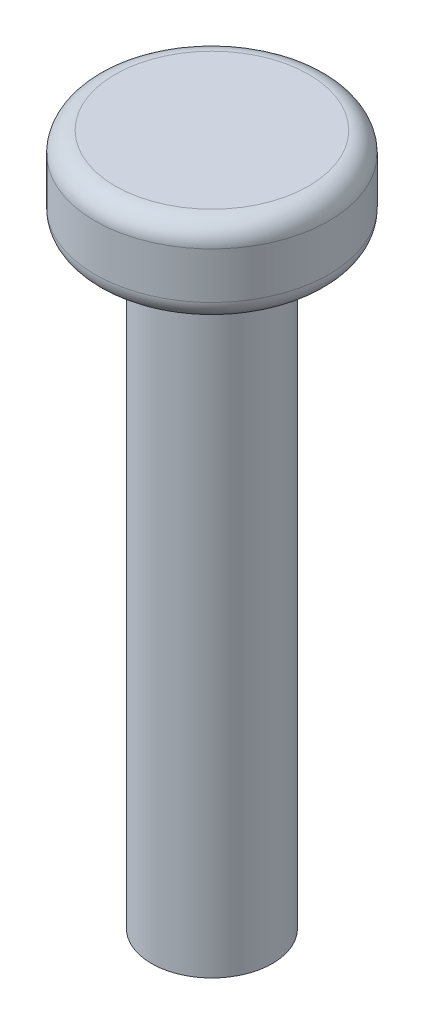
ISO-10303-21;
HEADER;
FILE_DESCRIPTION(('STEP AP214'),'2;1');
FILE_NAME('part.step','',(''),(''),'','','');
FILE_SCHEMA(('AUTOMOTIVE_DESIGN { 1 0 10303 214 1 1 1 1 }'));
ENDSEC;
DATA;
#1=APPLICATION_CONTEXT('core data for automotive mechanical design processes');
#2=APPLICATION_PROTOCOL_DEFINITION('international standard','automotive_design',2000,#1);
#3=PRODUCT_CONTEXT('',#1,'mechanical');
#4=PRODUCT('Part','Part','',(#3));
#5=PRODUCT_RELATED_PRODUCT_CATEGORY('part','',(#4));
#6=PRODUCT_DEFINITION_FORMATION('','',#4);
#7=PRODUCT_DEFINITION_CONTEXT('part definition',#1,'design');
#8=PRODUCT_DEFINITION('design','',#6,#7);
#9=PRODUCT_DEFINITION_SHAPE('','',#8);
#10=(LENGTH_UNIT() NAMED_UNIT(*) SI_UNIT(.MILLI.,.METRE.));
#11=(NAMED_UNIT(*) PLANE_ANGLE_UNIT() SI_UNIT($,.RADIAN.));
#12=(NAMED_UNIT(*) SI_UNIT($,.STERADIAN.) SOLID_ANGLE_UNIT());
#13=UNCERTAINTY_MEASURE_WITH_UNIT(LENGTH_MEASURE(1.E-05),#10,'distance_accuracy_value','');
#14=(GEOMETRIC_REPRESENTATION_CONTEXT(3) GLOBAL_UNCERTAINTY_ASSIGNED_CONTEXT((#13)) GLOBAL_UNIT_ASSIGNED_CONTEXT((#10,
#11,#12)) REPRESENTATION_CONTEXT('',''));
#15=CARTESIAN_POINT('',(0.,0.,0.));
#16=DIRECTION('',(0.,0.,1.));
#17=DIRECTION('',(1.,0.,0.));
#18=AXIS2_PLACEMENT_3D('',#15,#16,#17);
#19=CARTESIAN_POINT('',(0.,30.,0.));
#20=DIRECTION('',(0.,-1.,0.));
#21=DIRECTION('',(0.,0.,-1.));
#22=AXIS2_PLACEMENT_3D('',#19,#20,#21);
#23=CYLINDRICAL_SURFACE('',#22,3.);
#24=CARTESIAN_POINT('',(0.,30.,0.));
#25=DIRECTION('',(0.,1.,0.));
#26=DIRECTION('',(0.,0.,1.));
#27=AXIS2_PLACEMENT_3D('',#24,#25,#26);
#28=CIRCLE('',#27,3.);
#29=CARTESIAN_POINT('',(0.,30.,3.));
#30=VERTEX_POINT('',#29);
#31=EDGE_CURVE('E53',#30,#30,#28,.T.);
#32=ORIENTED_EDGE('',*,*,#31,.F.);
#33=EDGE_LOOP('',(#32));
#34=FACE_BOUND('',#33,.T.);
#35=CARTESIAN_POINT('',(0.,0.,0.));
#36=DIRECTION('',(0.,1.,0.));
#37=DIRECTION('',(0.,0.,1.));
#38=AXIS2_PLACEMENT_3D('',#35,#36,#37);
#39=CIRCLE('',#38,3.);
#40=CARTESIAN_POINT('',(0.,0.,3.));
#41=VERTEX_POINT('',#40);
#42=EDGE_CURVE('E54',#41,#41,#39,.T.);
#43=ORIENTED_EDGE('',*,*,#42,.T.);
#44=EDGE_LOOP('',(#43));
#45=FACE_BOUND('',#44,.T.);
#46=ADVANCED_FACE('F33',(#34,#45),#23,.T.);
#47=CARTESIAN_POINT('',(0.,0.,0.));
#48=DIRECTION('',(0.,1.,0.));
#49=DIRECTION('',(0.,0.,1.));
#50=AXIS2_PLACEMENT_3D('',#47,#48,#49);
#51=PLANE('',#50);
#52=ORIENTED_EDGE('',*,*,#42,.F.);
#53=EDGE_LOOP('',(#52));
#54=FACE_BOUND('',#53,.T.);
#55=ADVANCED_FACE('F64',(#54),#51,.F.);
#56=CARTESIAN_POINT('',(0.,34.3,0.));
#57=DIRECTION('',(0.,-1.,0.));
#58=DIRECTION('',(0.,0.,-1.));
#59=AXIS2_PLACEMENT_3D('',#56,#57,#58);
#60=CYLINDRICAL_SURFACE('',#59,5.8);
#61=CARTESIAN_POINT('',(0.,31.,0.));
#62=DIRECTION('',(0.,1.,0.));
#63=DIRECTION('',(0.,0.,1.));
#64=AXIS2_PLACEMENT_3D('',#61,#62,#63);
#65=CIRCLE('',#64,5.8);
#66=CARTESIAN_POINT('',(0.,31.,5.8));
#67=VERTEX_POINT('',#66);
#68=EDGE_CURVE('E44',#67,#67,#65,.T.);
#69=ORIENTED_EDGE('',*,*,#68,.T.);
#70=EDGE_LOOP('',(#69));
#71=FACE_BOUND('',#70,.T.);
#72=CARTESIAN_POINT('',(0.,33.3,0.));
#73=DIRECTION('',(0.,1.,0.));
#74=DIRECTION('',(0.,0.,1.));
#75=AXIS2_PLACEMENT_3D('',#72,#73,#74);
#76=CIRCLE('',#75,5.8);
#77=CARTESIAN_POINT('',(0.,33.3,5.8));
#78=VERTEX_POINT('',#77);
#79=EDGE_CURVE('E48',#78,#78,#76,.F.);
#80=ORIENTED_EDGE('',*,*,#79,.T.);
#81=EDGE_LOOP('',(#80));
#82=FACE_BOUND('',#81,.T.);
#83=ADVANCED_FACE('F69',(#71,#82),#60,.T.);
#84=CARTESIAN_POINT('',(0.,34.3,0.));
#85=DIRECTION('',(0.,1.,0.));
#86=DIRECTION('',(0.,0.,1.));
#87=AXIS2_PLACEMENT_3D('',#84,#85,#86);
#88=PLANE('',#87);
#89=CARTESIAN_POINT('',(0.,34.3,0.));
#90=DIRECTION('',(0.,1.,0.));
#91=DIRECTION('',(0.,0.,1.));
#92=AXIS2_PLACEMENT_3D('',#89,#90,#91);
#93=CIRCLE('',#92,4.8);
#94=CARTESIAN_POINT('',(0.,34.3,4.8));
#95=VERTEX_POINT('',#94);
#96=EDGE_CURVE('E10',#95,#95,#93,.T.);
#97=ORIENTED_EDGE('',*,*,#96,.T.);
#98=EDGE_LOOP('',(#97));
#99=FACE_BOUND('',#98,.T.);
#100=ADVANCED_FACE('F74',(#99),#88,.T.);
#101=CARTESIAN_POINT('',(0.,30.,0.));
#102=DIRECTION('',(0.,1.,0.));
#103=DIRECTION('',(0.,0.,1.));
#104=AXIS2_PLACEMENT_3D('',#101,#102,#103);
#105=PLANE('',#104);
#106=CARTESIAN_POINT('',(0.,30.,0.));
#107=DIRECTION('',(0.,1.,0.));
#108=DIRECTION('',(0.,0.,1.));
#109=AXIS2_PLACEMENT_3D('',#106,#107,#108);
#110=CIRCLE('',#109,4.8);
#111=CARTESIAN_POINT('',(0.,30.,4.8));
#112=VERTEX_POINT('',#111);
#113=EDGE_CURVE('E40',#112,#112,#110,.F.);
#114=ORIENTED_EDGE('',*,*,#113,.T.);
#115=EDGE_LOOP('',(#114));
#116=FACE_BOUND('',#115,.T.);
#117=ORIENTED_EDGE('',*,*,#31,.T.);
#118=EDGE_LOOP('',(#117));
#119=FACE_BOUND('',#118,.T.);
#120=ADVANCED_FACE('F60',(#116,#119),#105,.F.);
#121=CARTESIAN_POINT('',(0.,31.,0.));
#122=DIRECTION('',(0.,1.,0.));
#123=DIRECTION('',(0.,0.,1.));
#124=AXIS2_PLACEMENT_3D('',#121,#122,#123);
#125=TOROIDAL_SURFACE('',#124,4.8,1.);
#126=ORIENTED_EDGE('',*,*,#113,.F.);
#127=EDGE_LOOP('',(#126));
#128=FACE_BOUND('',#127,.T.);
#129=ORIENTED_EDGE('',*,*,#68,.F.);
#130=EDGE_LOOP('',(#129));
#131=FACE_BOUND('',#130,.T.);
#132=ADVANCED_FACE('F78',(#128,#131),#125,.T.);
#133=CARTESIAN_POINT('',(0.,33.3,0.));
#134=DIRECTION('',(0.,1.,0.));
#135=DIRECTION('',(0.,0.,1.));
#136=AXIS2_PLACEMENT_3D('',#133,#134,#135);
#137=TOROIDAL_SURFACE('',#136,4.8,1.);
#138=ORIENTED_EDGE('',*,*,#79,.F.);
#139=EDGE_LOOP('',(#138));
#140=FACE_BOUND('',#139,.T.);
#141=ORIENTED_EDGE('',*,*,#96,.F.);
#142=EDGE_LOOP('',(#141));
#143=FACE_BOUND('',#142,.T.);
#144=ADVANCED_FACE('F35',(#140,#143),#137,.T.);
#145=CLOSED_SHELL('',(#46,#55,#83,#100,#120,#132,#144));
#146=MANIFOLD_SOLID_BREP('B2',#145);
#147=ADVANCED_BREP_SHAPE_REPRESENTATION('',(#18,#146),#14);
#148=SHAPE_DEFINITION_REPRESENTATION(#9,#147);
ENDSEC;
END-ISO-10303-21;
